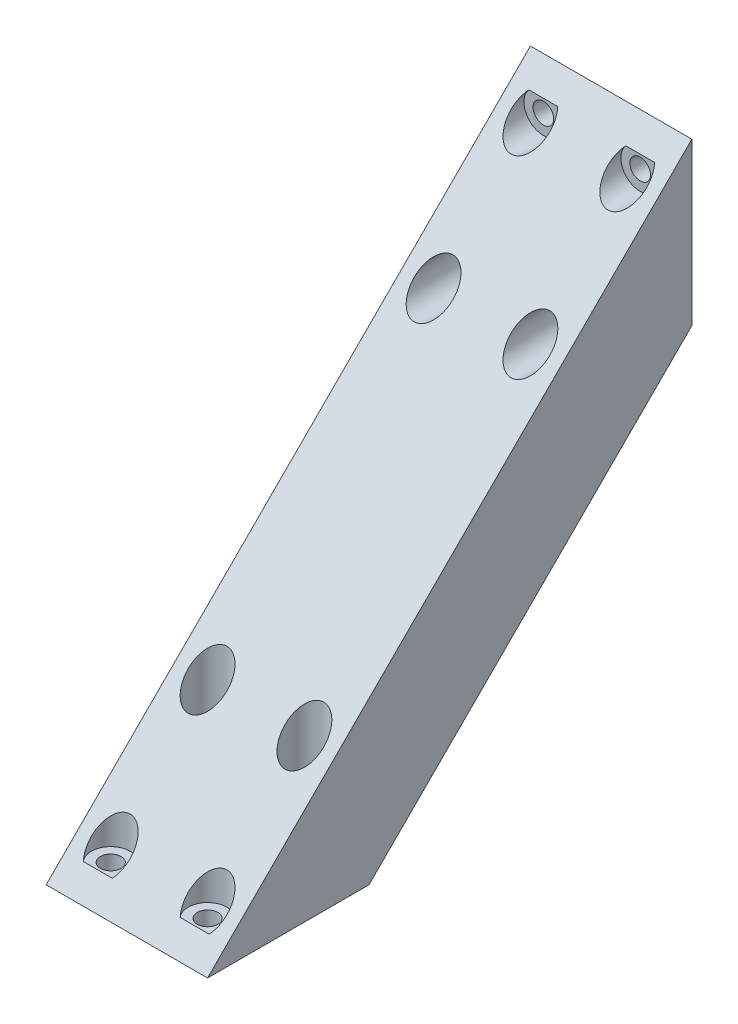
ISO-10303-21;
HEADER;
FILE_DESCRIPTION(('STEP AP214'),'2;1');
FILE_NAME('part.step','',(''),(''),'','','');
FILE_SCHEMA(('AUTOMOTIVE_DESIGN { 1 0 10303 214 1 1 1 1 }'));
ENDSEC;
DATA;
#1=APPLICATION_CONTEXT('core data for automotive mechanical design processes');
#2=APPLICATION_PROTOCOL_DEFINITION('international standard','automotive_design',2000,#1);
#3=PRODUCT_CONTEXT('',#1,'mechanical');
#4=PRODUCT('Part','Part','',(#3));
#5=PRODUCT_RELATED_PRODUCT_CATEGORY('part','',(#4));
#6=PRODUCT_DEFINITION_FORMATION('','',#4);
#7=PRODUCT_DEFINITION_CONTEXT('part definition',#1,'design');
#8=PRODUCT_DEFINITION('design','',#6,#7);
#9=PRODUCT_DEFINITION_SHAPE('','',#8);
#10=(LENGTH_UNIT() NAMED_UNIT(*) SI_UNIT(.MILLI.,.METRE.));
#11=(NAMED_UNIT(*) PLANE_ANGLE_UNIT() SI_UNIT($,.RADIAN.));
#12=(NAMED_UNIT(*) SI_UNIT($,.STERADIAN.) SOLID_ANGLE_UNIT());
#13=UNCERTAINTY_MEASURE_WITH_UNIT(LENGTH_MEASURE(1.E-05),#10,'distance_accuracy_value','');
#14=(GEOMETRIC_REPRESENTATION_CONTEXT(3) GLOBAL_UNCERTAINTY_ASSIGNED_CONTEXT((#13)) GLOBAL_UNIT_ASSIGNED_CONTEXT((#10,
#11,#12)) REPRESENTATION_CONTEXT('',''));
#15=CARTESIAN_POINT('',(0.,0.,0.));
#16=DIRECTION('',(0.,0.,1.));
#17=DIRECTION('',(1.,0.,0.));
#18=AXIS2_PLACEMENT_3D('',#15,#16,#17);
#19=CARTESIAN_POINT('',(25.,25.0000000000001,0.));
#20=DIRECTION('',(0.,0.,1.));
#21=DIRECTION('',(1.,0.,0.));
#22=AXIS2_PLACEMENT_3D('',#19,#20,#21);
#23=PLANE('',#22);
#24=CARTESIAN_POINT('',(20.,20.0000000000001,0.));
#25=DIRECTION('',(0.,0.,-1.));
#26=DIRECTION('',(-1.,0.,0.));
#27=AXIS2_PLACEMENT_3D('',#24,#25,#26);
#28=CIRCLE('',#27,1.6);
#29=CARTESIAN_POINT('',(18.4,20.0000000000001,0.));
#30=VERTEX_POINT('',#29);
#31=EDGE_CURVE('E334',#30,#30,#28,.T.);
#32=ORIENTED_EDGE('',*,*,#31,.F.);
#33=EDGE_LOOP('',(#32));
#34=FACE_BOUND('',#33,.T.);
#35=CARTESIAN_POINT('',(5.,5.00000000000011,0.));
#36=DIRECTION('',(0.,0.,-1.));
#37=DIRECTION('',(-1.,0.,0.));
#38=AXIS2_PLACEMENT_3D('',#35,#36,#37);
#39=CIRCLE('',#38,1.6);
#40=CARTESIAN_POINT('',(3.4,5.00000000000011,0.));
#41=VERTEX_POINT('',#40);
#42=EDGE_CURVE('E327',#41,#41,#39,.T.);
#43=ORIENTED_EDGE('',*,*,#42,.F.);
#44=EDGE_LOOP('',(#43));
#45=FACE_BOUND('',#44,.T.);
#46=CARTESIAN_POINT('',(20.,5.00000000000011,0.));
#47=DIRECTION('',(0.,0.,-1.));
#48=DIRECTION('',(-1.,0.,0.));
#49=AXIS2_PLACEMENT_3D('',#46,#47,#48);
#50=CIRCLE('',#49,1.6);
#51=CARTESIAN_POINT('',(18.4,5.00000000000011,0.));
#52=VERTEX_POINT('',#51);
#53=EDGE_CURVE('E323',#52,#52,#50,.T.);
#54=ORIENTED_EDGE('',*,*,#53,.F.);
#55=EDGE_LOOP('',(#54));
#56=FACE_BOUND('',#55,.T.);
#57=CARTESIAN_POINT('',(5.,20.0000000000001,0.));
#58=DIRECTION('',(0.,0.,-1.));
#59=DIRECTION('',(-1.,0.,0.));
#60=AXIS2_PLACEMENT_3D('',#57,#58,#59);
#61=CIRCLE('',#60,1.6);
#62=CARTESIAN_POINT('',(3.4,20.0000000000001,0.));
#63=VERTEX_POINT('',#62);
#64=EDGE_CURVE('E339',#63,#63,#61,.T.);
#65=ORIENTED_EDGE('',*,*,#64,.F.);
#66=EDGE_LOOP('',(#65));
#67=FACE_BOUND('',#66,.T.);
#68=DIRECTION('',(0.,1.,0.));
#69=VECTOR('',#68,1.);
#70=CARTESIAN_POINT('',(0.,25.0000000000001,0.));
#71=LINE('',#70,#69);
#72=CARTESIAN_POINT('',(0.,0.,0.));
#73=VERTEX_POINT('',#72);
#74=CARTESIAN_POINT('',(0.,25.0000000000001,0.));
#75=VERTEX_POINT('',#74);
#76=EDGE_CURVE('E168',#73,#75,#71,.T.);
#77=ORIENTED_EDGE('',*,*,#76,.T.);
#78=DIRECTION('',(-1.,0.,0.));
#79=VECTOR('',#78,1.);
#80=CARTESIAN_POINT('',(25.,25.0000000000001,0.));
#81=LINE('',#80,#79);
#82=CARTESIAN_POINT('',(25.,25.0000000000001,0.));
#83=VERTEX_POINT('',#82);
#84=EDGE_CURVE('E11',#83,#75,#81,.T.);
#85=ORIENTED_EDGE('',*,*,#84,.F.);
#86=DIRECTION('',(0.,1.,0.));
#87=VECTOR('',#86,1.);
#88=CARTESIAN_POINT('',(25.,25.0000000000001,0.));
#89=LINE('',#88,#87);
#90=CARTESIAN_POINT('',(25.,0.,0.));
#91=VERTEX_POINT('',#90);
#92=EDGE_CURVE('E169',#91,#83,#89,.T.);
#93=ORIENTED_EDGE('',*,*,#92,.F.);
#94=DIRECTION('',(-1.,0.,0.));
#95=VECTOR('',#94,1.);
#96=CARTESIAN_POINT('',(25.,0.,0.));
#97=LINE('',#96,#95);
#98=EDGE_CURVE('E179',#91,#73,#97,.T.);
#99=ORIENTED_EDGE('',*,*,#98,.T.);
#100=EDGE_LOOP('',(#77,#85,#93,#99));
#101=FACE_BOUND('',#100,.T.);
#102=ADVANCED_FACE('F33',(#34,#45,#56,#67,#101),#23,.F.);
#103=CARTESIAN_POINT('',(25.,-50.0000000000002,75.));
#104=DIRECTION('',(0.,-0.707106781186546,-0.707106781186549));
#105=DIRECTION('',(0.,0.707106781186549,-0.707106781186546));
#106=AXIS2_PLACEMENT_3D('',#103,#104,#105);
#107=PLANE('',#106);
#108=DIRECTION('',(-1.,0.,0.));
#109=VECTOR('',#108,1.);
#110=CARTESIAN_POINT('',(5.,22.0000000000001,3.));
#111=LINE('',#110,#109);
#112=CARTESIAN_POINT('',(7.23606797749982,22.0000000000001,3.));
#113=VERTEX_POINT('',#112);
#114=CARTESIAN_POINT('',(2.76393202250018,22.0000000000001,3.));
#115=VERTEX_POINT('',#114);
#116=EDGE_CURVE('E101',#113,#115,#111,.T.);
#117=ORIENTED_EDGE('',*,*,#116,.F.);
#118=CARTESIAN_POINT('',(5.,20.0000000000001,4.99999999999996));
#119=DIRECTION('',(0.,-0.707106781186546,-0.707106781186549));
#120=DIRECTION('',(0.,0.707106781186549,-0.707106781186546));
#121=AXIS2_PLACEMENT_3D('',#118,#119,#120);
#122=ELLIPSE('',#121,4.24264068711928,3.);
#123=EDGE_CURVE('E46',#115,#113,#122,.F.);
#124=ORIENTED_EDGE('',*,*,#123,.F.);
#125=EDGE_LOOP('',(#117,#124));
#126=FACE_BOUND('',#125,.T.);
#127=CARTESIAN_POINT('',(5.,5.00000000000011,19.9999999999999));
#128=DIRECTION('',(0.,-0.707106781186546,-0.707106781186549));
#129=DIRECTION('',(0.,0.707106781186549,-0.707106781186546));
#130=AXIS2_PLACEMENT_3D('',#127,#128,#129);
#131=ELLIPSE('',#130,4.24264068711928,3.);
#132=CARTESIAN_POINT('',(5.,8.00000000000012,16.9999999999999));
#133=VERTEX_POINT('',#132);
#134=EDGE_CURVE('E352',#133,#133,#131,.F.);
#135=ORIENTED_EDGE('',*,*,#134,.F.);
#136=EDGE_LOOP('',(#135));
#137=FACE_BOUND('',#136,.T.);
#138=CARTESIAN_POINT('',(20.,5.00000000000011,19.9999999999999));
#139=DIRECTION('',(0.,-0.707106781186546,-0.707106781186549));
#140=DIRECTION('',(0.,0.707106781186549,-0.707106781186546));
#141=AXIS2_PLACEMENT_3D('',#138,#139,#140);
#142=ELLIPSE('',#141,4.24264068711928,3.);
#143=CARTESIAN_POINT('',(20.,8.00000000000012,16.9999999999999));
#144=VERTEX_POINT('',#143);
#145=EDGE_CURVE('E114',#144,#144,#142,.F.);
#146=ORIENTED_EDGE('',*,*,#145,.F.);
#147=EDGE_LOOP('',(#146));
#148=FACE_BOUND('',#147,.T.);
#149=DIRECTION('',(-1.,0.,0.));
#150=VECTOR('',#149,1.);
#151=CARTESIAN_POINT('',(20.,22.0000000000001,3.));
#152=LINE('',#151,#150);
#153=CARTESIAN_POINT('',(22.2360679774998,22.0000000000001,3.));
#154=VERTEX_POINT('',#153);
#155=CARTESIAN_POINT('',(17.7639320225002,22.0000000000001,3.));
#156=VERTEX_POINT('',#155);
#157=EDGE_CURVE('E111',#154,#156,#152,.T.);
#158=ORIENTED_EDGE('',*,*,#157,.F.);
#159=CARTESIAN_POINT('',(20.,20.0000000000001,4.99999999999996));
#160=DIRECTION('',(0.,-0.707106781186546,-0.707106781186549));
#161=DIRECTION('',(0.,0.707106781186549,-0.707106781186546));
#162=AXIS2_PLACEMENT_3D('',#159,#160,#161);
#163=ELLIPSE('',#162,4.24264068711928,3.);
#164=EDGE_CURVE('E53',#156,#154,#163,.F.);
#165=ORIENTED_EDGE('',*,*,#164,.F.);
#166=EDGE_LOOP('',(#158,#165));
#167=FACE_BOUND('',#166,.T.);
#168=CARTESIAN_POINT('',(5.,-30.0000000000001,55.));
#169=DIRECTION('',(0.,-0.707106781186546,-0.707106781186549));
#170=DIRECTION('',(0.,-0.707106781186549,0.707106781186546));
#171=AXIS2_PLACEMENT_3D('',#168,#169,#170);
#172=ELLIPSE('',#171,4.2426406871193,3.);
#173=CARTESIAN_POINT('',(5.,-33.0000000000001,58.));
#174=VERTEX_POINT('',#173);
#175=EDGE_CURVE('E155',#174,#174,#172,.F.);
#176=ORIENTED_EDGE('',*,*,#175,.F.);
#177=EDGE_LOOP('',(#176));
#178=FACE_BOUND('',#177,.T.);
#179=CARTESIAN_POINT('',(20.,-30.0000000000001,55.));
#180=DIRECTION('',(0.,-0.707106781186546,-0.707106781186549));
#181=DIRECTION('',(0.,-0.707106781186549,0.707106781186546));
#182=AXIS2_PLACEMENT_3D('',#179,#180,#181);
#183=ELLIPSE('',#182,4.2426406871193,3.);
#184=CARTESIAN_POINT('',(20.,-33.0000000000001,58.));
#185=VERTEX_POINT('',#184);
#186=EDGE_CURVE('E146',#185,#185,#183,.F.);
#187=ORIENTED_EDGE('',*,*,#186,.F.);
#188=EDGE_LOOP('',(#187));
#189=FACE_BOUND('',#188,.T.);
#190=DIRECTION('',(1.,0.,0.));
#191=VECTOR('',#190,1.);
#192=CARTESIAN_POINT('',(0.,-47.0000000000002,72.));
#193=LINE('',#192,#191);
#194=CARTESIAN_POINT('',(17.7639320225002,-47.0000000000002,72.));
#195=VERTEX_POINT('',#194);
#196=CARTESIAN_POINT('',(22.2360679774998,-47.0000000000002,72.));
#197=VERTEX_POINT('',#196);
#198=EDGE_CURVE('E148',#195,#197,#193,.T.);
#199=ORIENTED_EDGE('',*,*,#198,.F.);
#200=CARTESIAN_POINT('',(20.,-45.0000000000002,70.));
#201=DIRECTION('',(0.,-0.707106781186546,-0.707106781186549));
#202=DIRECTION('',(0.,-0.707106781186549,0.707106781186546));
#203=AXIS2_PLACEMENT_3D('',#200,#201,#202);
#204=ELLIPSE('',#203,4.2426406871193,3.);
#205=EDGE_CURVE('E143',#197,#195,#204,.F.);
#206=ORIENTED_EDGE('',*,*,#205,.F.);
#207=EDGE_LOOP('',(#199,#206));
#208=FACE_BOUND('',#207,.T.);
#209=DIRECTION('',(1.,0.,0.));
#210=VECTOR('',#209,1.);
#211=CARTESIAN_POINT('',(0.,-47.0000000000002,72.));
#212=LINE('',#211,#210);
#213=CARTESIAN_POINT('',(2.76393202250022,-47.0000000000002,72.));
#214=VERTEX_POINT('',#213);
#215=CARTESIAN_POINT('',(7.23606797749978,-47.0000000000002,72.));
#216=VERTEX_POINT('',#215);
#217=EDGE_CURVE('E165',#214,#216,#212,.T.);
#218=ORIENTED_EDGE('',*,*,#217,.F.);
#219=CARTESIAN_POINT('',(5.,-45.0000000000002,70.));
#220=DIRECTION('',(0.,-0.707106781186546,-0.707106781186549));
#221=DIRECTION('',(0.,-0.707106781186549,0.707106781186546));
#222=AXIS2_PLACEMENT_3D('',#219,#220,#221);
#223=ELLIPSE('',#222,4.2426406871193,3.);
#224=EDGE_CURVE('E151',#216,#214,#223,.F.);
#225=ORIENTED_EDGE('',*,*,#224,.F.);
#226=EDGE_LOOP('',(#218,#225));
#227=FACE_BOUND('',#226,.T.);
#228=DIRECTION('',(0.,-0.707106781186549,0.707106781186546));
#229=VECTOR('',#228,1.);
#230=CARTESIAN_POINT('',(0.,-50.0000000000002,75.));
#231=LINE('',#230,#229);
#232=CARTESIAN_POINT('',(0.,-50.0000000000002,75.));
#233=VERTEX_POINT('',#232);
#234=EDGE_CURVE('E182',#75,#233,#231,.T.);
#235=ORIENTED_EDGE('',*,*,#234,.T.);
#236=DIRECTION('',(-1.,0.,0.));
#237=VECTOR('',#236,1.);
#238=CARTESIAN_POINT('',(25.,-50.0000000000002,75.));
#239=LINE('',#238,#237);
#240=CARTESIAN_POINT('',(25.,-50.0000000000002,75.));
#241=VERTEX_POINT('',#240);
#242=EDGE_CURVE('E40',#241,#233,#239,.T.);
#243=ORIENTED_EDGE('',*,*,#242,.F.);
#244=DIRECTION('',(0.,-0.707106781186549,0.707106781186546));
#245=VECTOR('',#244,1.);
#246=CARTESIAN_POINT('',(25.,-50.0000000000002,75.));
#247=LINE('',#246,#245);
#248=EDGE_CURVE('E172',#83,#241,#247,.T.);
#249=ORIENTED_EDGE('',*,*,#248,.F.);
#250=ORIENTED_EDGE('',*,*,#84,.T.);
#251=EDGE_LOOP('',(#235,#243,#249,#250));
#252=FACE_BOUND('',#251,.T.);
#253=ADVANCED_FACE('F106',(#126,#137,#148,#167,#178,#189,#208,#227,#252),#107,.F.);
#254=CARTESIAN_POINT('',(25.,-50.0000000000002,50.));
#255=DIRECTION('',(0.,1.,0.));
#256=DIRECTION('',(0.,0.,1.));
#257=AXIS2_PLACEMENT_3D('',#254,#255,#256);
#258=PLANE('',#257);
#259=CARTESIAN_POINT('',(5.,-50.0000000000002,70.));
#260=DIRECTION('',(0.,-1.,0.));
#261=DIRECTION('',(0.,0.,-1.));
#262=AXIS2_PLACEMENT_3D('',#259,#260,#261);
#263=CIRCLE('',#262,1.6);
#264=CARTESIAN_POINT('',(5.,-50.0000000000002,68.4));
#265=VERTEX_POINT('',#264);
#266=EDGE_CURVE('E118',#265,#265,#263,.T.);
#267=ORIENTED_EDGE('',*,*,#266,.F.);
#268=EDGE_LOOP('',(#267));
#269=FACE_BOUND('',#268,.T.);
#270=CARTESIAN_POINT('',(5.,-50.0000000000002,55.));
#271=DIRECTION('',(0.,-1.,0.));
#272=DIRECTION('',(0.,0.,-1.));
#273=AXIS2_PLACEMENT_3D('',#270,#271,#272);
#274=CIRCLE('',#273,1.6);
#275=CARTESIAN_POINT('',(5.,-50.0000000000002,53.4));
#276=VERTEX_POINT('',#275);
#277=EDGE_CURVE('E127',#276,#276,#274,.T.);
#278=ORIENTED_EDGE('',*,*,#277,.F.);
#279=EDGE_LOOP('',(#278));
#280=FACE_BOUND('',#279,.T.);
#281=CARTESIAN_POINT('',(20.,-50.0000000000002,55.));
#282=DIRECTION('',(0.,-1.,0.));
#283=DIRECTION('',(0.,0.,-1.));
#284=AXIS2_PLACEMENT_3D('',#281,#282,#283);
#285=CIRCLE('',#284,1.6);
#286=CARTESIAN_POINT('',(20.,-50.0000000000002,53.4));
#287=VERTEX_POINT('',#286);
#288=EDGE_CURVE('E119',#287,#287,#285,.T.);
#289=ORIENTED_EDGE('',*,*,#288,.F.);
#290=EDGE_LOOP('',(#289));
#291=FACE_BOUND('',#290,.T.);
#292=CARTESIAN_POINT('',(20.,-50.0000000000002,70.));
#293=DIRECTION('',(0.,-1.,0.));
#294=DIRECTION('',(0.,0.,-1.));
#295=AXIS2_PLACEMENT_3D('',#292,#293,#294);
#296=CIRCLE('',#295,1.6);
#297=CARTESIAN_POINT('',(20.,-50.0000000000002,68.4));
#298=VERTEX_POINT('',#297);
#299=EDGE_CURVE('E126',#298,#298,#296,.T.);
#300=ORIENTED_EDGE('',*,*,#299,.F.);
#301=EDGE_LOOP('',(#300));
#302=FACE_BOUND('',#301,.T.);
#303=DIRECTION('',(0.,0.,-1.));
#304=VECTOR('',#303,1.);
#305=CARTESIAN_POINT('',(0.,-50.0000000000002,50.));
#306=LINE('',#305,#304);
#307=CARTESIAN_POINT('',(0.,-50.0000000000002,50.));
#308=VERTEX_POINT('',#307);
#309=EDGE_CURVE('E184',#233,#308,#306,.T.);
#310=ORIENTED_EDGE('',*,*,#309,.T.);
#311=DIRECTION('',(-1.,0.,0.));
#312=VECTOR('',#311,1.);
#313=CARTESIAN_POINT('',(25.,-50.0000000000002,50.));
#314=LINE('',#313,#312);
#315=CARTESIAN_POINT('',(25.,-50.0000000000002,50.));
#316=VERTEX_POINT('',#315);
#317=EDGE_CURVE('E189',#316,#308,#314,.T.);
#318=ORIENTED_EDGE('',*,*,#317,.F.);
#319=DIRECTION('',(0.,0.,-1.));
#320=VECTOR('',#319,1.);
#321=CARTESIAN_POINT('',(25.,-50.0000000000002,50.));
#322=LINE('',#321,#320);
#323=EDGE_CURVE('E175',#241,#316,#322,.T.);
#324=ORIENTED_EDGE('',*,*,#323,.F.);
#325=ORIENTED_EDGE('',*,*,#242,.T.);
#326=EDGE_LOOP('',(#310,#318,#324,#325));
#327=FACE_BOUND('',#326,.T.);
#328=ADVANCED_FACE('F196',(#269,#280,#291,#302,#327),#258,.F.);
#329=CARTESIAN_POINT('',(25.,0.,0.));
#330=DIRECTION('',(0.,0.707106781186546,0.707106781186549));
#331=DIRECTION('',(0.,-0.707106781186549,0.707106781186546));
#332=AXIS2_PLACEMENT_3D('',#329,#330,#331);
#333=PLANE('',#332);
#334=DIRECTION('',(0.,0.707106781186549,-0.707106781186546));
#335=VECTOR('',#334,1.);
#336=CARTESIAN_POINT('',(0.,0.,0.));
#337=LINE('',#336,#335);
#338=EDGE_CURVE('E173',#308,#73,#337,.T.);
#339=ORIENTED_EDGE('',*,*,#338,.T.);
#340=ORIENTED_EDGE('',*,*,#98,.F.);
#341=DIRECTION('',(0.,0.707106781186549,-0.707106781186546));
#342=VECTOR('',#341,1.);
#343=CARTESIAN_POINT('',(25.,0.,0.));
#344=LINE('',#343,#342);
#345=EDGE_CURVE('E177',#316,#91,#344,.T.);
#346=ORIENTED_EDGE('',*,*,#345,.F.);
#347=ORIENTED_EDGE('',*,*,#317,.T.);
#348=EDGE_LOOP('',(#339,#340,#346,#347));
#349=FACE_BOUND('',#348,.T.);
#350=ADVANCED_FACE('F205',(#349),#333,.F.);
#351=CARTESIAN_POINT('',(25.,0.,0.));
#352=DIRECTION('',(-1.,0.,0.));
#353=DIRECTION('',(0.,0.,1.));
#354=AXIS2_PLACEMENT_3D('',#351,#352,#353);
#355=PLANE('',#354);
#356=ORIENTED_EDGE('',*,*,#92,.T.);
#357=ORIENTED_EDGE('',*,*,#248,.T.);
#358=ORIENTED_EDGE('',*,*,#323,.T.);
#359=ORIENTED_EDGE('',*,*,#345,.T.);
#360=EDGE_LOOP('',(#356,#357,#358,#359));
#361=FACE_BOUND('',#360,.T.);
#362=ADVANCED_FACE('F211',(#361),#355,.F.);
#363=CARTESIAN_POINT('',(0.,0.,0.));
#364=DIRECTION('',(-1.,0.,0.));
#365=DIRECTION('',(0.,0.,1.));
#366=AXIS2_PLACEMENT_3D('',#363,#364,#365);
#367=PLANE('',#366);
#368=ORIENTED_EDGE('',*,*,#76,.F.);
#369=ORIENTED_EDGE('',*,*,#338,.F.);
#370=ORIENTED_EDGE('',*,*,#309,.F.);
#371=ORIENTED_EDGE('',*,*,#234,.F.);
#372=EDGE_LOOP('',(#368,#369,#370,#371));
#373=FACE_BOUND('',#372,.T.);
#374=ADVANCED_FACE('F202',(#373),#367,.T.);
#375=CARTESIAN_POINT('',(5.,25.0010000000001,70.));
#376=DIRECTION('',(0.,-1.,0.));
#377=DIRECTION('',(0.,0.,-1.));
#378=AXIS2_PLACEMENT_3D('',#375,#376,#377);
#379=CYLINDRICAL_SURFACE('',#378,3.);
#380=ORIENTED_EDGE('',*,*,#224,.T.);
#381=CARTESIAN_POINT('',(5.,-47.0000000000002,70.));
#382=DIRECTION('',(0.,-1.,0.));
#383=DIRECTION('',(0.,0.,-1.));
#384=AXIS2_PLACEMENT_3D('',#381,#382,#383);
#385=CIRCLE('',#384,3.);
#386=EDGE_CURVE('E163',#214,#216,#385,.T.);
#387=ORIENTED_EDGE('',*,*,#386,.T.);
#388=EDGE_LOOP('',(#380,#387));
#389=FACE_BOUND('',#388,.T.);
#390=ADVANCED_FACE('F225',(#389),#379,.F.);
#391=CARTESIAN_POINT('',(0.,-47.0000000000002,0.));
#392=DIRECTION('',(0.,-1.,0.));
#393=DIRECTION('',(0.,0.,-1.));
#394=AXIS2_PLACEMENT_3D('',#391,#392,#393);
#395=PLANE('',#394);
#396=CARTESIAN_POINT('',(5.,-47.0000000000002,70.));
#397=DIRECTION('',(0.,-1.,0.));
#398=DIRECTION('',(0.,0.,-1.));
#399=AXIS2_PLACEMENT_3D('',#396,#397,#398);
#400=CIRCLE('',#399,1.6);
#401=CARTESIAN_POINT('',(5.,-47.0000000000002,68.4));
#402=VERTEX_POINT('',#401);
#403=EDGE_CURVE('E130',#402,#402,#400,.F.);
#404=ORIENTED_EDGE('',*,*,#403,.F.);
#405=EDGE_LOOP('',(#404));
#406=FACE_BOUND('',#405,.T.);
#407=ORIENTED_EDGE('',*,*,#217,.T.);
#408=ORIENTED_EDGE('',*,*,#386,.F.);
#409=EDGE_LOOP('',(#407,#408));
#410=FACE_BOUND('',#409,.T.);
#411=ADVANCED_FACE('F230',(#406,#410),#395,.F.);
#412=CARTESIAN_POINT('',(20.,25.0010000000001,70.));
#413=DIRECTION('',(0.,-1.,0.));
#414=DIRECTION('',(0.,0.,-1.));
#415=AXIS2_PLACEMENT_3D('',#412,#413,#414);
#416=CYLINDRICAL_SURFACE('',#415,3.);
#417=ORIENTED_EDGE('',*,*,#205,.T.);
#418=CARTESIAN_POINT('',(20.,-47.0000000000002,70.));
#419=DIRECTION('',(0.,-1.,0.));
#420=DIRECTION('',(0.,0.,-1.));
#421=AXIS2_PLACEMENT_3D('',#418,#419,#420);
#422=CIRCLE('',#421,3.);
#423=EDGE_CURVE('E145',#195,#197,#422,.T.);
#424=ORIENTED_EDGE('',*,*,#423,.T.);
#425=EDGE_LOOP('',(#417,#424));
#426=FACE_BOUND('',#425,.T.);
#427=ADVANCED_FACE('F234',(#426),#416,.F.);
#428=CARTESIAN_POINT('',(0.,-47.0000000000002,0.));
#429=DIRECTION('',(0.,-1.,0.));
#430=DIRECTION('',(0.,0.,-1.));
#431=AXIS2_PLACEMENT_3D('',#428,#429,#430);
#432=PLANE('',#431);
#433=CARTESIAN_POINT('',(20.,-47.0000000000002,70.));
#434=DIRECTION('',(0.,-1.,0.));
#435=DIRECTION('',(0.,0.,-1.));
#436=AXIS2_PLACEMENT_3D('',#433,#434,#435);
#437=CIRCLE('',#436,1.6);
#438=CARTESIAN_POINT('',(20.,-47.0000000000002,68.4));
#439=VERTEX_POINT('',#438);
#440=EDGE_CURVE('E139',#439,#439,#437,.F.);
#441=ORIENTED_EDGE('',*,*,#440,.F.);
#442=EDGE_LOOP('',(#441));
#443=FACE_BOUND('',#442,.T.);
#444=ORIENTED_EDGE('',*,*,#198,.T.);
#445=ORIENTED_EDGE('',*,*,#423,.F.);
#446=EDGE_LOOP('',(#444,#445));
#447=FACE_BOUND('',#446,.T.);
#448=ADVANCED_FACE('F249',(#443,#447),#432,.F.);
#449=CARTESIAN_POINT('',(20.,25.0010000000001,55.));
#450=DIRECTION('',(0.,-1.,0.));
#451=DIRECTION('',(0.,0.,-1.));
#452=AXIS2_PLACEMENT_3D('',#449,#450,#451);
#453=CYLINDRICAL_SURFACE('',#452,3.);
#454=CARTESIAN_POINT('',(20.,-47.0000000000002,55.));
#455=DIRECTION('',(0.,-1.,0.));
#456=DIRECTION('',(0.,0.,-1.));
#457=AXIS2_PLACEMENT_3D('',#454,#455,#456);
#458=CIRCLE('',#457,3.);
#459=CARTESIAN_POINT('',(20.,-47.0000000000002,52.));
#460=VERTEX_POINT('',#459);
#461=EDGE_CURVE('E152',#460,#460,#458,.T.);
#462=ORIENTED_EDGE('',*,*,#461,.T.);
#463=EDGE_LOOP('',(#462));
#464=FACE_BOUND('',#463,.T.);
#465=ORIENTED_EDGE('',*,*,#186,.T.);
#466=EDGE_LOOP('',(#465));
#467=FACE_BOUND('',#466,.T.);
#468=ADVANCED_FACE('F246',(#464,#467),#453,.F.);
#469=CARTESIAN_POINT('',(0.,-47.0000000000002,0.));
#470=DIRECTION('',(0.,-1.,0.));
#471=DIRECTION('',(0.,0.,-1.));
#472=AXIS2_PLACEMENT_3D('',#469,#470,#471);
#473=PLANE('',#472);
#474=CARTESIAN_POINT('',(20.,-47.0000000000002,55.));
#475=DIRECTION('',(0.,-1.,0.));
#476=DIRECTION('',(0.,0.,-1.));
#477=AXIS2_PLACEMENT_3D('',#474,#475,#476);
#478=CIRCLE('',#477,1.6);
#479=CARTESIAN_POINT('',(20.,-47.0000000000002,53.4));
#480=VERTEX_POINT('',#479);
#481=EDGE_CURVE('E122',#480,#480,#478,.F.);
#482=ORIENTED_EDGE('',*,*,#481,.F.);
#483=EDGE_LOOP('',(#482));
#484=FACE_BOUND('',#483,.T.);
#485=ORIENTED_EDGE('',*,*,#461,.F.);
#486=EDGE_LOOP('',(#485));
#487=FACE_BOUND('',#486,.T.);
#488=ADVANCED_FACE('F240',(#484,#487),#473,.F.);
#489=CARTESIAN_POINT('',(5.,25.0010000000001,55.));
#490=DIRECTION('',(0.,-1.,0.));
#491=DIRECTION('',(0.,0.,-1.));
#492=AXIS2_PLACEMENT_3D('',#489,#490,#491);
#493=CYLINDRICAL_SURFACE('',#492,3.);
#494=CARTESIAN_POINT('',(5.,-47.0000000000002,55.));
#495=DIRECTION('',(0.,-1.,0.));
#496=DIRECTION('',(0.,0.,-1.));
#497=AXIS2_PLACEMENT_3D('',#494,#495,#496);
#498=CIRCLE('',#497,3.);
#499=CARTESIAN_POINT('',(5.,-47.0000000000002,52.));
#500=VERTEX_POINT('',#499);
#501=EDGE_CURVE('E142',#500,#500,#498,.T.);
#502=ORIENTED_EDGE('',*,*,#501,.T.);
#503=EDGE_LOOP('',(#502));
#504=FACE_BOUND('',#503,.T.);
#505=ORIENTED_EDGE('',*,*,#175,.T.);
#506=EDGE_LOOP('',(#505));
#507=FACE_BOUND('',#506,.T.);
#508=ADVANCED_FACE('F236',(#504,#507),#493,.F.);
#509=CARTESIAN_POINT('',(0.,-47.0000000000002,0.));
#510=DIRECTION('',(0.,-1.,0.));
#511=DIRECTION('',(0.,0.,-1.));
#512=AXIS2_PLACEMENT_3D('',#509,#510,#511);
#513=PLANE('',#512);
#514=CARTESIAN_POINT('',(5.,-47.0000000000002,55.));
#515=DIRECTION('',(0.,-1.,0.));
#516=DIRECTION('',(0.,0.,-1.));
#517=AXIS2_PLACEMENT_3D('',#514,#515,#516);
#518=CIRCLE('',#517,1.6);
#519=CARTESIAN_POINT('',(5.,-47.0000000000002,53.4));
#520=VERTEX_POINT('',#519);
#521=EDGE_CURVE('E123',#520,#520,#518,.F.);
#522=ORIENTED_EDGE('',*,*,#521,.F.);
#523=EDGE_LOOP('',(#522));
#524=FACE_BOUND('',#523,.T.);
#525=ORIENTED_EDGE('',*,*,#501,.F.);
#526=EDGE_LOOP('',(#525));
#527=FACE_BOUND('',#526,.T.);
#528=ADVANCED_FACE('F239',(#524,#527),#513,.F.);
#529=CARTESIAN_POINT('',(5.,25.0010000000001,55.));
#530=DIRECTION('',(0.,-1.,0.));
#531=DIRECTION('',(0.,0.,-1.));
#532=AXIS2_PLACEMENT_3D('',#529,#530,#531);
#533=CYLINDRICAL_SURFACE('',#532,1.6);
#534=ORIENTED_EDGE('',*,*,#277,.T.);
#535=EDGE_LOOP('',(#534));
#536=FACE_BOUND('',#535,.T.);
#537=ORIENTED_EDGE('',*,*,#521,.T.);
#538=EDGE_LOOP('',(#537));
#539=FACE_BOUND('',#538,.T.);
#540=ADVANCED_FACE('F244',(#536,#539),#533,.F.);
#541=CARTESIAN_POINT('',(20.,25.0010000000001,55.));
#542=DIRECTION('',(0.,-1.,0.));
#543=DIRECTION('',(0.,0.,-1.));
#544=AXIS2_PLACEMENT_3D('',#541,#542,#543);
#545=CYLINDRICAL_SURFACE('',#544,1.6);
#546=ORIENTED_EDGE('',*,*,#288,.T.);
#547=EDGE_LOOP('',(#546));
#548=FACE_BOUND('',#547,.T.);
#549=ORIENTED_EDGE('',*,*,#481,.T.);
#550=EDGE_LOOP('',(#549));
#551=FACE_BOUND('',#550,.T.);
#552=ADVANCED_FACE('F264',(#548,#551),#545,.F.);
#553=CARTESIAN_POINT('',(20.,25.0010000000001,70.));
#554=DIRECTION('',(0.,-1.,0.));
#555=DIRECTION('',(0.,0.,-1.));
#556=AXIS2_PLACEMENT_3D('',#553,#554,#555);
#557=CYLINDRICAL_SURFACE('',#556,1.6);
#558=ORIENTED_EDGE('',*,*,#299,.T.);
#559=EDGE_LOOP('',(#558));
#560=FACE_BOUND('',#559,.T.);
#561=ORIENTED_EDGE('',*,*,#440,.T.);
#562=EDGE_LOOP('',(#561));
#563=FACE_BOUND('',#562,.T.);
#564=ADVANCED_FACE('F260',(#560,#563),#557,.F.);
#565=CARTESIAN_POINT('',(5.,25.0010000000001,70.));
#566=DIRECTION('',(0.,-1.,0.));
#567=DIRECTION('',(0.,0.,-1.));
#568=AXIS2_PLACEMENT_3D('',#565,#566,#567);
#569=CYLINDRICAL_SURFACE('',#568,1.6);
#570=ORIENTED_EDGE('',*,*,#266,.T.);
#571=EDGE_LOOP('',(#570));
#572=FACE_BOUND('',#571,.T.);
#573=ORIENTED_EDGE('',*,*,#403,.T.);
#574=EDGE_LOOP('',(#573));
#575=FACE_BOUND('',#574,.T.);
#576=ADVANCED_FACE('F263',(#572,#575),#569,.F.);
#577=CARTESIAN_POINT('',(20.,20.0000000000001,75.001));
#578=DIRECTION('',(0.,0.,-1.));
#579=DIRECTION('',(-1.,0.,0.));
#580=AXIS2_PLACEMENT_3D('',#577,#578,#579);
#581=CYLINDRICAL_SURFACE('',#580,3.);
#582=ORIENTED_EDGE('',*,*,#164,.T.);
#583=CARTESIAN_POINT('',(20.,20.0000000000001,3.));
#584=DIRECTION('',(0.,0.,-1.));
#585=DIRECTION('',(-1.,0.,0.));
#586=AXIS2_PLACEMENT_3D('',#583,#584,#585);
#587=CIRCLE('',#586,3.);
#588=EDGE_CURVE('E116',#154,#156,#587,.T.);
#589=ORIENTED_EDGE('',*,*,#588,.T.);
#590=EDGE_LOOP('',(#582,#589));
#591=FACE_BOUND('',#590,.T.);
#592=ADVANCED_FACE('F268',(#591),#581,.F.);
#593=CARTESIAN_POINT('',(20.,20.0000000000001,3.));
#594=DIRECTION('',(0.,0.,-1.));
#595=DIRECTION('',(-1.,0.,0.));
#596=AXIS2_PLACEMENT_3D('',#593,#594,#595);
#597=PLANE('',#596);
#598=CARTESIAN_POINT('',(20.,20.0000000000001,3.));
#599=DIRECTION('',(0.,0.,-1.));
#600=DIRECTION('',(-1.,0.,0.));
#601=AXIS2_PLACEMENT_3D('',#598,#599,#600);
#602=CIRCLE('',#601,1.6);
#603=CARTESIAN_POINT('',(18.4,20.0000000000001,3.));
#604=VERTEX_POINT('',#603);
#605=EDGE_CURVE('E337',#604,#604,#602,.F.);
#606=ORIENTED_EDGE('',*,*,#605,.F.);
#607=EDGE_LOOP('',(#606));
#608=FACE_BOUND('',#607,.T.);
#609=ORIENTED_EDGE('',*,*,#157,.T.);
#610=ORIENTED_EDGE('',*,*,#588,.F.);
#611=EDGE_LOOP('',(#609,#610));
#612=FACE_BOUND('',#611,.T.);
#613=ADVANCED_FACE('F278',(#608,#612),#597,.F.);
#614=CARTESIAN_POINT('',(20.,5.00000000000011,75.001));
#615=DIRECTION('',(0.,0.,-1.));
#616=DIRECTION('',(-1.,0.,0.));
#617=AXIS2_PLACEMENT_3D('',#614,#615,#616);
#618=CYLINDRICAL_SURFACE('',#617,3.);
#619=CARTESIAN_POINT('',(20.,5.00000000000011,3.));
#620=DIRECTION('',(0.,0.,-1.));
#621=DIRECTION('',(-1.,0.,0.));
#622=AXIS2_PLACEMENT_3D('',#619,#620,#621);
#623=CIRCLE('',#622,3.);
#624=CARTESIAN_POINT('',(17.,5.00000000000011,3.));
#625=VERTEX_POINT('',#624);
#626=EDGE_CURVE('E349',#625,#625,#623,.T.);
#627=ORIENTED_EDGE('',*,*,#626,.T.);
#628=EDGE_LOOP('',(#627));
#629=FACE_BOUND('',#628,.T.);
#630=ORIENTED_EDGE('',*,*,#145,.T.);
#631=EDGE_LOOP('',(#630));
#632=FACE_BOUND('',#631,.T.);
#633=ADVANCED_FACE('F281',(#629,#632),#618,.F.);
#634=CARTESIAN_POINT('',(20.,5.00000000000011,3.));
#635=DIRECTION('',(0.,0.,-1.));
#636=DIRECTION('',(-1.,0.,0.));
#637=AXIS2_PLACEMENT_3D('',#634,#635,#636);
#638=PLANE('',#637);
#639=CARTESIAN_POINT('',(20.,5.00000000000011,3.));
#640=DIRECTION('',(0.,0.,-1.));
#641=DIRECTION('',(-1.,0.,0.));
#642=AXIS2_PLACEMENT_3D('',#639,#640,#641);
#643=CIRCLE('',#642,1.6);
#644=CARTESIAN_POINT('',(18.4,5.00000000000011,3.));
#645=VERTEX_POINT('',#644);
#646=EDGE_CURVE('E326',#645,#645,#643,.F.);
#647=ORIENTED_EDGE('',*,*,#646,.F.);
#648=EDGE_LOOP('',(#647));
#649=FACE_BOUND('',#648,.T.);
#650=ORIENTED_EDGE('',*,*,#626,.F.);
#651=EDGE_LOOP('',(#650));
#652=FACE_BOUND('',#651,.T.);
#653=ADVANCED_FACE('F293',(#649,#652),#638,.F.);
#654=CARTESIAN_POINT('',(5.,5.00000000000011,75.001));
#655=DIRECTION('',(0.,0.,-1.));
#656=DIRECTION('',(-1.,0.,0.));
#657=AXIS2_PLACEMENT_3D('',#654,#655,#656);
#658=CYLINDRICAL_SURFACE('',#657,3.);
#659=CARTESIAN_POINT('',(5.,5.00000000000011,3.));
#660=DIRECTION('',(0.,0.,-1.));
#661=DIRECTION('',(-1.,0.,0.));
#662=AXIS2_PLACEMENT_3D('',#659,#660,#661);
#663=CIRCLE('',#662,3.);
#664=CARTESIAN_POINT('',(2.,5.00000000000011,3.));
#665=VERTEX_POINT('',#664);
#666=EDGE_CURVE('E99',#665,#665,#663,.T.);
#667=ORIENTED_EDGE('',*,*,#666,.T.);
#668=EDGE_LOOP('',(#667));
#669=FACE_BOUND('',#668,.T.);
#670=ORIENTED_EDGE('',*,*,#134,.T.);
#671=EDGE_LOOP('',(#670));
#672=FACE_BOUND('',#671,.T.);
#673=ADVANCED_FACE('F290',(#669,#672),#658,.F.);
#674=CARTESIAN_POINT('',(5.,5.00000000000011,3.));
#675=DIRECTION('',(0.,0.,-1.));
#676=DIRECTION('',(-1.,0.,0.));
#677=AXIS2_PLACEMENT_3D('',#674,#675,#676);
#678=PLANE('',#677);
#679=CARTESIAN_POINT('',(5.,5.00000000000011,3.));
#680=DIRECTION('',(0.,0.,-1.));
#681=DIRECTION('',(-1.,0.,0.));
#682=AXIS2_PLACEMENT_3D('',#679,#680,#681);
#683=CIRCLE('',#682,1.6);
#684=CARTESIAN_POINT('',(3.4,5.00000000000011,3.));
#685=VERTEX_POINT('',#684);
#686=EDGE_CURVE('E330',#685,#685,#683,.F.);
#687=ORIENTED_EDGE('',*,*,#686,.F.);
#688=EDGE_LOOP('',(#687));
#689=FACE_BOUND('',#688,.T.);
#690=ORIENTED_EDGE('',*,*,#666,.F.);
#691=EDGE_LOOP('',(#690));
#692=FACE_BOUND('',#691,.T.);
#693=ADVANCED_FACE('F285',(#689,#692),#678,.F.);
#694=CARTESIAN_POINT('',(5.,20.0000000000001,75.001));
#695=DIRECTION('',(0.,0.,-1.));
#696=DIRECTION('',(-1.,0.,0.));
#697=AXIS2_PLACEMENT_3D('',#694,#695,#696);
#698=CYLINDRICAL_SURFACE('',#697,3.);
#699=ORIENTED_EDGE('',*,*,#123,.T.);
#700=CARTESIAN_POINT('',(5.,20.0000000000001,3.));
#701=DIRECTION('',(0.,0.,-1.));
#702=DIRECTION('',(-1.,0.,0.));
#703=AXIS2_PLACEMENT_3D('',#700,#701,#702);
#704=CIRCLE('',#703,3.);
#705=EDGE_CURVE('E94',#113,#115,#704,.T.);
#706=ORIENTED_EDGE('',*,*,#705,.T.);
#707=EDGE_LOOP('',(#699,#706));
#708=FACE_BOUND('',#707,.T.);
#709=ADVANCED_FACE('F96',(#708),#698,.F.);
#710=CARTESIAN_POINT('',(5.,20.0000000000001,3.));
#711=DIRECTION('',(0.,0.,-1.));
#712=DIRECTION('',(-1.,0.,0.));
#713=AXIS2_PLACEMENT_3D('',#710,#711,#712);
#714=PLANE('',#713);
#715=CARTESIAN_POINT('',(5.,20.0000000000001,3.));
#716=DIRECTION('',(0.,0.,-1.));
#717=DIRECTION('',(-1.,0.,0.));
#718=AXIS2_PLACEMENT_3D('',#715,#716,#717);
#719=CIRCLE('',#718,1.6);
#720=CARTESIAN_POINT('',(3.4,20.0000000000001,3.));
#721=VERTEX_POINT('',#720);
#722=EDGE_CURVE('E104',#721,#721,#719,.F.);
#723=ORIENTED_EDGE('',*,*,#722,.F.);
#724=EDGE_LOOP('',(#723));
#725=FACE_BOUND('',#724,.T.);
#726=ORIENTED_EDGE('',*,*,#116,.T.);
#727=ORIENTED_EDGE('',*,*,#705,.F.);
#728=EDGE_LOOP('',(#726,#727));
#729=FACE_BOUND('',#728,.T.);
#730=ADVANCED_FACE('F102',(#725,#729),#714,.F.);
#731=CARTESIAN_POINT('',(5.,20.0000000000001,75.001));
#732=DIRECTION('',(0.,0.,-1.));
#733=DIRECTION('',(-1.,0.,0.));
#734=AXIS2_PLACEMENT_3D('',#731,#732,#733);
#735=CYLINDRICAL_SURFACE('',#734,1.6);
#736=ORIENTED_EDGE('',*,*,#64,.T.);
#737=EDGE_LOOP('',(#736));
#738=FACE_BOUND('',#737,.T.);
#739=ORIENTED_EDGE('',*,*,#722,.T.);
#740=EDGE_LOOP('',(#739));
#741=FACE_BOUND('',#740,.T.);
#742=ADVANCED_FACE('F288',(#738,#741),#735,.F.);
#743=CARTESIAN_POINT('',(5.,5.00000000000011,75.001));
#744=DIRECTION('',(0.,0.,-1.));
#745=DIRECTION('',(-1.,0.,0.));
#746=AXIS2_PLACEMENT_3D('',#743,#744,#745);
#747=CYLINDRICAL_SURFACE('',#746,1.6);
#748=ORIENTED_EDGE('',*,*,#42,.T.);
#749=EDGE_LOOP('',(#748));
#750=FACE_BOUND('',#749,.T.);
#751=ORIENTED_EDGE('',*,*,#686,.T.);
#752=EDGE_LOOP('',(#751));
#753=FACE_BOUND('',#752,.T.);
#754=ADVANCED_FACE('F306',(#750,#753),#747,.F.);
#755=CARTESIAN_POINT('',(20.,5.00000000000011,75.001));
#756=DIRECTION('',(0.,0.,-1.));
#757=DIRECTION('',(-1.,0.,0.));
#758=AXIS2_PLACEMENT_3D('',#755,#756,#757);
#759=CYLINDRICAL_SURFACE('',#758,1.6);
#760=ORIENTED_EDGE('',*,*,#53,.T.);
#761=EDGE_LOOP('',(#760));
#762=FACE_BOUND('',#761,.T.);
#763=ORIENTED_EDGE('',*,*,#646,.T.);
#764=EDGE_LOOP('',(#763));
#765=FACE_BOUND('',#764,.T.);
#766=ADVANCED_FACE('F310',(#762,#765),#759,.F.);
#767=CARTESIAN_POINT('',(20.,20.0000000000001,75.001));
#768=DIRECTION('',(0.,0.,-1.));
#769=DIRECTION('',(-1.,0.,0.));
#770=AXIS2_PLACEMENT_3D('',#767,#768,#769);
#771=CYLINDRICAL_SURFACE('',#770,1.6);
#772=ORIENTED_EDGE('',*,*,#31,.T.);
#773=EDGE_LOOP('',(#772));
#774=FACE_BOUND('',#773,.T.);
#775=ORIENTED_EDGE('',*,*,#605,.T.);
#776=EDGE_LOOP('',(#775));
#777=FACE_BOUND('',#776,.T.);
#778=ADVANCED_FACE('F312',(#774,#777),#771,.F.);
#779=CLOSED_SHELL('',(#102,#253,#328,#350,#362,#374,#390,#411,#427,#448,#468,#488,#508,#528,
#540,#552,#564,#576,#592,#613,#633,#653,#673,#693,#709,#730,#742,#754,#766,#778));
#780=MANIFOLD_SOLID_BREP('B2',#779);
#781=ADVANCED_BREP_SHAPE_REPRESENTATION('',(#18,#780),#14);
#782=SHAPE_DEFINITION_REPRESENTATION(#9,#781);
ENDSEC;
END-ISO-10303-21;
